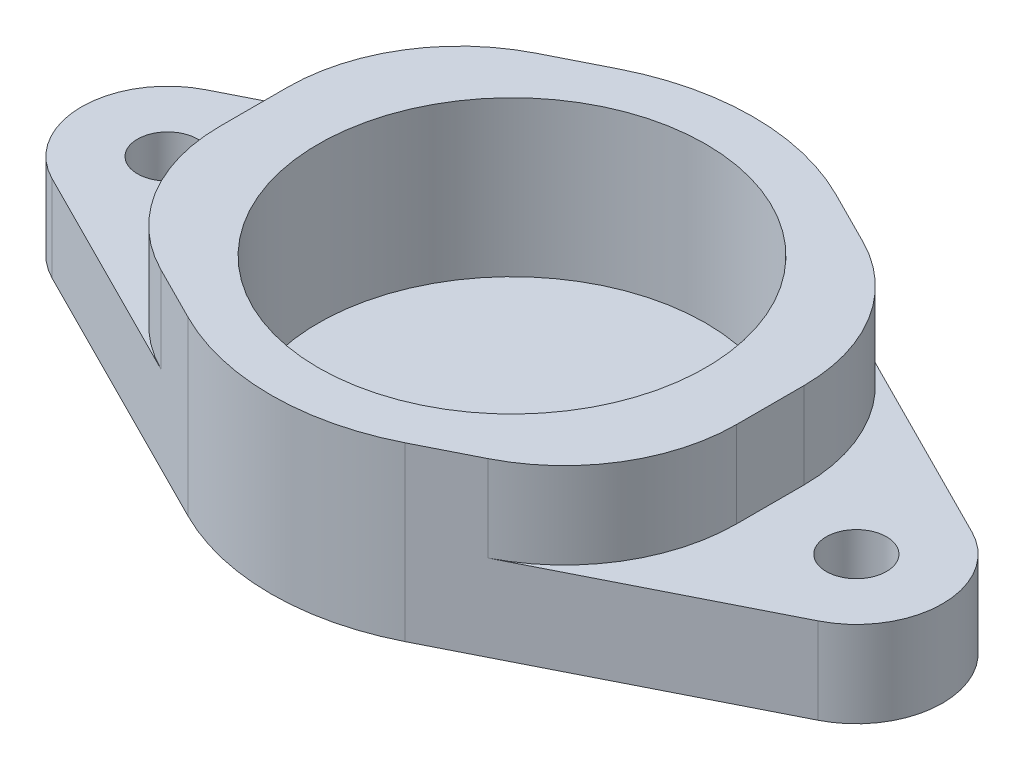
ISO-10303-21;
HEADER;
FILE_DESCRIPTION(('STEP AP214'),'2;1');
FILE_NAME('part.step','',(''),(''),'','','');
FILE_SCHEMA(('AUTOMOTIVE_DESIGN { 1 0 10303 214 1 1 1 1 }'));
ENDSEC;
DATA;
#1=APPLICATION_CONTEXT('core data for automotive mechanical design processes');
#2=APPLICATION_PROTOCOL_DEFINITION('international standard','automotive_design',2000,#1);
#3=PRODUCT_CONTEXT('',#1,'mechanical');
#4=PRODUCT('Part','Part','',(#3));
#5=PRODUCT_RELATED_PRODUCT_CATEGORY('part','',(#4));
#6=PRODUCT_DEFINITION_FORMATION('','',#4);
#7=PRODUCT_DEFINITION_CONTEXT('part definition',#1,'design');
#8=PRODUCT_DEFINITION('design','',#6,#7);
#9=PRODUCT_DEFINITION_SHAPE('','',#8);
#10=(LENGTH_UNIT() NAMED_UNIT(*) SI_UNIT(.MILLI.,.METRE.));
#11=(NAMED_UNIT(*) PLANE_ANGLE_UNIT() SI_UNIT($,.RADIAN.));
#12=(NAMED_UNIT(*) SI_UNIT($,.STERADIAN.) SOLID_ANGLE_UNIT());
#13=UNCERTAINTY_MEASURE_WITH_UNIT(LENGTH_MEASURE(1.E-05),#10,'distance_accuracy_value','');
#14=(GEOMETRIC_REPRESENTATION_CONTEXT(3) GLOBAL_UNCERTAINTY_ASSIGNED_CONTEXT((#13)) GLOBAL_UNIT_ASSIGNED_CONTEXT((#10,
#11,#12)) REPRESENTATION_CONTEXT('',''));
#15=CARTESIAN_POINT('',(0.,0.,0.));
#16=DIRECTION('',(0.,0.,1.));
#17=DIRECTION('',(1.,0.,0.));
#18=AXIS2_PLACEMENT_3D('',#15,#16,#17);
#19=CARTESIAN_POINT('',(-20.,10.,0.));
#20=DIRECTION('',(0.,1.,0.));
#21=DIRECTION('',(0.,0.,1.));
#22=AXIS2_PLACEMENT_3D('',#19,#20,#21);
#23=PLANE('',#22);
#24=DIRECTION('',(0.893028554974588,0.,-0.45));
#25=VECTOR('',#24,1.);
#26=CARTESIAN_POINT('',(6.3,10.,12.5023997696442));
#27=LINE('',#26,#25);
#28=CARTESIAN_POINT('',(6.3,10.,12.5023997696442));
#29=VERTEX_POINT('',#28);
#30=CARTESIAN_POINT('',(9.49999999999999,10.,10.8899093380914));
#31=VERTEX_POINT('',#30);
#32=EDGE_CURVE('E293',#29,#31,#27,.T.);
#33=ORIENTED_EDGE('',*,*,#32,.T.);
#34=CARTESIAN_POINT('',(4.99999999999999,10.,1.95962378834549));
#35=DIRECTION('',(0.,1.,0.));
#36=DIRECTION('',(0.,0.,1.));
#37=AXIS2_PLACEMENT_3D('',#34,#35,#36);
#38=CIRCLE('',#37,10.);
#39=CARTESIAN_POINT('',(15.,10.,1.95962378834549));
#40=VERTEX_POINT('',#39);
#41=EDGE_CURVE('E229',#31,#40,#38,.T.);
#42=ORIENTED_EDGE('',*,*,#41,.T.);
#43=DIRECTION('',(0.,0.,1.));
#44=VECTOR('',#43,1.);
#45=CARTESIAN_POINT('',(15.,10.,-14.));
#46=LINE('',#45,#44);
#47=CARTESIAN_POINT('',(15.,10.,-1.95962378834549));
#48=VERTEX_POINT('',#47);
#49=EDGE_CURVE('E279',#48,#40,#46,.T.);
#50=ORIENTED_EDGE('',*,*,#49,.F.);
#51=CARTESIAN_POINT('',(4.99999999999999,10.,-1.95962378834549));
#52=DIRECTION('',(0.,1.,0.));
#53=DIRECTION('',(0.,0.,1.));
#54=AXIS2_PLACEMENT_3D('',#51,#52,#53);
#55=CIRCLE('',#54,10.);
#56=CARTESIAN_POINT('',(9.49999999999999,10.,-10.8899093380914));
#57=VERTEX_POINT('',#56);
#58=EDGE_CURVE('E226',#48,#57,#55,.T.);
#59=ORIENTED_EDGE('',*,*,#58,.T.);
#60=DIRECTION('',(-0.893028554974588,0.,-0.45));
#61=VECTOR('',#60,1.);
#62=CARTESIAN_POINT('',(6.3,10.,-12.5023997696442));
#63=LINE('',#62,#61);
#64=CARTESIAN_POINT('',(6.3,10.,-12.5023997696442));
#65=VERTEX_POINT('',#64);
#66=EDGE_CURVE('E287',#57,#65,#63,.T.);
#67=ORIENTED_EDGE('',*,*,#66,.T.);
#68=CARTESIAN_POINT('',(0.,10.,0.));
#69=DIRECTION('',(0.,1.,0.));
#70=DIRECTION('',(0.,0.,1.));
#71=AXIS2_PLACEMENT_3D('',#68,#69,#70);
#72=CIRCLE('',#71,14.);
#73=CARTESIAN_POINT('',(-6.3,10.,-12.5023997696442));
#74=VERTEX_POINT('',#73);
#75=EDGE_CURVE('E183',#65,#74,#72,.T.);
#76=ORIENTED_EDGE('',*,*,#75,.T.);
#77=DIRECTION('',(-0.893028554974588,0.,0.45));
#78=VECTOR('',#77,1.);
#79=CARTESIAN_POINT('',(-22.25,10.,-4.46514277487293));
#80=LINE('',#79,#78);
#81=CARTESIAN_POINT('',(-9.5,10.,-10.8899093380914));
#82=VERTEX_POINT('',#81);
#83=EDGE_CURVE('E176',#74,#82,#80,.T.);
#84=ORIENTED_EDGE('',*,*,#83,.T.);
#85=CARTESIAN_POINT('',(-5.,10.,-1.95962378834549));
#86=DIRECTION('',(0.,1.,0.));
#87=DIRECTION('',(0.,0.,1.));
#88=AXIS2_PLACEMENT_3D('',#85,#86,#87);
#89=CIRCLE('',#88,10.);
#90=CARTESIAN_POINT('',(-15.,10.,-1.95962378834549));
#91=VERTEX_POINT('',#90);
#92=EDGE_CURVE('E223',#82,#91,#89,.T.);
#93=ORIENTED_EDGE('',*,*,#92,.T.);
#94=DIRECTION('',(0.,0.,1.));
#95=VECTOR('',#94,1.);
#96=CARTESIAN_POINT('',(-15.,10.,-14.));
#97=LINE('',#96,#95);
#98=CARTESIAN_POINT('',(-15.,10.,1.95962378834549));
#99=VERTEX_POINT('',#98);
#100=EDGE_CURVE('E363',#91,#99,#97,.T.);
#101=ORIENTED_EDGE('',*,*,#100,.T.);
#102=CARTESIAN_POINT('',(-5.,10.,1.95962378834549));
#103=DIRECTION('',(0.,1.,0.));
#104=DIRECTION('',(0.,0.,1.));
#105=AXIS2_PLACEMENT_3D('',#102,#103,#104);
#106=CIRCLE('',#105,10.);
#107=CARTESIAN_POINT('',(-9.5,10.,10.8899093380914));
#108=VERTEX_POINT('',#107);
#109=EDGE_CURVE('E220',#99,#108,#106,.T.);
#110=ORIENTED_EDGE('',*,*,#109,.T.);
#111=DIRECTION('',(0.893028554974588,0.,0.45));
#112=VECTOR('',#111,1.);
#113=CARTESIAN_POINT('',(-22.25,10.,4.46514277487294));
#114=LINE('',#113,#112);
#115=CARTESIAN_POINT('',(-6.3,10.,12.5023997696442));
#116=VERTEX_POINT('',#115);
#117=EDGE_CURVE('E328',#108,#116,#114,.T.);
#118=ORIENTED_EDGE('',*,*,#117,.T.);
#119=CARTESIAN_POINT('',(0.,10.,0.));
#120=DIRECTION('',(0.,1.,0.));
#121=DIRECTION('',(0.,0.,1.));
#122=AXIS2_PLACEMENT_3D('',#119,#120,#121);
#123=CIRCLE('',#122,14.);
#124=EDGE_CURVE('E298',#116,#29,#123,.T.);
#125=ORIENTED_EDGE('',*,*,#124,.T.);
#126=EDGE_LOOP('',(#33,#42,#50,#59,#67,#76,#84,#93,#101,#110,#118,#125));
#127=FACE_BOUND('',#126,.T.);
#128=CARTESIAN_POINT('',(0.,10.,0.));
#129=DIRECTION('',(0.,1.,0.));
#130=DIRECTION('',(0.,0.,1.));
#131=AXIS2_PLACEMENT_3D('',#128,#129,#130);
#132=CIRCLE('',#131,11.25);
#133=CARTESIAN_POINT('',(0.,10.,11.25));
#134=VERTEX_POINT('',#133);
#135=EDGE_CURVE('E343',#134,#134,#132,.T.);
#136=ORIENTED_EDGE('',*,*,#135,.F.);
#137=EDGE_LOOP('',(#136));
#138=FACE_BOUND('',#137,.T.);
#139=ADVANCED_FACE('F39',(#127,#138),#23,.T.);
#140=CARTESIAN_POINT('',(-20.,0.,0.));
#141=DIRECTION('',(0.,1.,0.));
#142=DIRECTION('',(0.,0.,1.));
#143=AXIS2_PLACEMENT_3D('',#140,#141,#142);
#144=PLANE('',#143);
#145=CARTESIAN_POINT('',(-20.,0.,0.));
#146=DIRECTION('',(0.,1.,0.));
#147=DIRECTION('',(0.,0.,1.));
#148=AXIS2_PLACEMENT_3D('',#145,#146,#147);
#149=CIRCLE('',#148,5.);
#150=CARTESIAN_POINT('',(-22.25,0.,-4.46514277487293));
#151=VERTEX_POINT('',#150);
#152=CARTESIAN_POINT('',(-22.25,0.,4.46514277487294));
#153=VERTEX_POINT('',#152);
#154=EDGE_CURVE('E302',#151,#153,#149,.T.);
#155=ORIENTED_EDGE('',*,*,#154,.F.);
#156=DIRECTION('',(-0.893028554974588,0.,0.45));
#157=VECTOR('',#156,1.);
#158=CARTESIAN_POINT('',(-22.25,0.,-4.46514277487293));
#159=LINE('',#158,#157);
#160=CARTESIAN_POINT('',(-6.3,0.,-12.5023997696442));
#161=VERTEX_POINT('',#160);
#162=EDGE_CURVE('E172',#161,#151,#159,.T.);
#163=ORIENTED_EDGE('',*,*,#162,.F.);
#164=CARTESIAN_POINT('',(0.,0.,0.));
#165=DIRECTION('',(0.,1.,0.));
#166=DIRECTION('',(0.,0.,1.));
#167=AXIS2_PLACEMENT_3D('',#164,#165,#166);
#168=CIRCLE('',#167,14.);
#169=CARTESIAN_POINT('',(6.3,0.,-12.5023997696442));
#170=VERTEX_POINT('',#169);
#171=EDGE_CURVE('E322',#170,#161,#168,.T.);
#172=ORIENTED_EDGE('',*,*,#171,.F.);
#173=DIRECTION('',(-0.893028554974588,0.,-0.45));
#174=VECTOR('',#173,1.);
#175=CARTESIAN_POINT('',(6.3,0.,-12.5023997696442));
#176=LINE('',#175,#174);
#177=CARTESIAN_POINT('',(22.25,0.,-4.46514277487293));
#178=VERTEX_POINT('',#177);
#179=EDGE_CURVE('E320',#178,#170,#176,.T.);
#180=ORIENTED_EDGE('',*,*,#179,.F.);
#181=CARTESIAN_POINT('',(20.,0.,0.));
#182=DIRECTION('',(0.,1.,0.));
#183=DIRECTION('',(0.,0.,1.));
#184=AXIS2_PLACEMENT_3D('',#181,#182,#183);
#185=CIRCLE('',#184,5.);
#186=CARTESIAN_POINT('',(22.25,0.,4.46514277487293));
#187=VERTEX_POINT('',#186);
#188=EDGE_CURVE('E316',#187,#178,#185,.T.);
#189=ORIENTED_EDGE('',*,*,#188,.F.);
#190=DIRECTION('',(0.893028554974588,0.,-0.45));
#191=VECTOR('',#190,1.);
#192=CARTESIAN_POINT('',(6.3,0.,12.5023997696442));
#193=LINE('',#192,#191);
#194=CARTESIAN_POINT('',(6.3,0.,12.5023997696442));
#195=VERTEX_POINT('',#194);
#196=EDGE_CURVE('E312',#195,#187,#193,.T.);
#197=ORIENTED_EDGE('',*,*,#196,.F.);
#198=CARTESIAN_POINT('',(0.,0.,0.));
#199=DIRECTION('',(0.,1.,0.));
#200=DIRECTION('',(0.,0.,1.));
#201=AXIS2_PLACEMENT_3D('',#198,#199,#200);
#202=CIRCLE('',#201,14.);
#203=CARTESIAN_POINT('',(-6.3,0.,12.5023997696442));
#204=VERTEX_POINT('',#203);
#205=EDGE_CURVE('E309',#204,#195,#202,.T.);
#206=ORIENTED_EDGE('',*,*,#205,.F.);
#207=DIRECTION('',(0.893028554974588,0.,0.45));
#208=VECTOR('',#207,1.);
#209=CARTESIAN_POINT('',(-22.25,0.,4.46514277487294));
#210=LINE('',#209,#208);
#211=EDGE_CURVE('E305',#153,#204,#210,.T.);
#212=ORIENTED_EDGE('',*,*,#211,.F.);
#213=EDGE_LOOP('',(#155,#163,#172,#180,#189,#197,#206,#212));
#214=FACE_BOUND('',#213,.T.);
#215=CARTESIAN_POINT('',(20.,0.,0.));
#216=DIRECTION('',(0.,1.,0.));
#217=DIRECTION('',(0.,0.,1.));
#218=AXIS2_PLACEMENT_3D('',#215,#216,#217);
#219=CIRCLE('',#218,1.75);
#220=CARTESIAN_POINT('',(20.,0.,1.75));
#221=VERTEX_POINT('',#220);
#222=EDGE_CURVE('E306',#221,#221,#219,.T.);
#223=ORIENTED_EDGE('',*,*,#222,.T.);
#224=EDGE_LOOP('',(#223));
#225=FACE_BOUND('',#224,.T.);
#226=CARTESIAN_POINT('',(-20.,0.,0.));
#227=DIRECTION('',(0.,1.,0.));
#228=DIRECTION('',(0.,0.,1.));
#229=AXIS2_PLACEMENT_3D('',#226,#227,#228);
#230=CIRCLE('',#229,1.75);
#231=CARTESIAN_POINT('',(-20.,0.,1.75));
#232=VERTEX_POINT('',#231);
#233=EDGE_CURVE('E338',#232,#232,#230,.T.);
#234=ORIENTED_EDGE('',*,*,#233,.T.);
#235=EDGE_LOOP('',(#234));
#236=FACE_BOUND('',#235,.T.);
#237=ADVANCED_FACE('F398',(#214,#225,#236),#144,.F.);
#238=CARTESIAN_POINT('',(-20.,10.,0.));
#239=DIRECTION('',(0.,-1.,0.));
#240=DIRECTION('',(0.,0.,-1.));
#241=AXIS2_PLACEMENT_3D('',#238,#239,#240);
#242=CYLINDRICAL_SURFACE('',#241,5.);
#243=DIRECTION('',(0.,-1.,0.));
#244=VECTOR('',#243,1.);
#245=CARTESIAN_POINT('',(-22.25,10.,4.46514277487294));
#246=LINE('',#245,#244);
#247=CARTESIAN_POINT('',(-22.25,5.,4.46514277487294));
#248=VERTEX_POINT('',#247);
#249=EDGE_CURVE('E156',#248,#153,#246,.T.);
#250=ORIENTED_EDGE('',*,*,#249,.F.);
#251=CARTESIAN_POINT('',(-20.,5.,0.));
#252=DIRECTION('',(0.,-1.,0.));
#253=DIRECTION('',(1.,0.,0.));
#254=AXIS2_PLACEMENT_3D('',#251,#252,#253);
#255=CIRCLE('',#254,5.);
#256=CARTESIAN_POINT('',(-22.25,5.,-4.46514277487293));
#257=VERTEX_POINT('',#256);
#258=EDGE_CURVE('E149',#248,#257,#255,.T.);
#259=ORIENTED_EDGE('',*,*,#258,.T.);
#260=DIRECTION('',(0.,-1.,0.));
#261=VECTOR('',#260,1.);
#262=CARTESIAN_POINT('',(-22.25,10.,-4.46514277487293));
#263=LINE('',#262,#261);
#264=EDGE_CURVE('E154',#257,#151,#263,.T.);
#265=ORIENTED_EDGE('',*,*,#264,.T.);
#266=ORIENTED_EDGE('',*,*,#154,.T.);
#267=EDGE_LOOP('',(#250,#259,#265,#266));
#268=FACE_BOUND('',#267,.T.);
#269=ADVANCED_FACE('F151',(#268),#242,.T.);
#270=CARTESIAN_POINT('',(-22.25,10.,4.46514277487294));
#271=DIRECTION('',(0.45,0.,-0.893028554974588));
#272=DIRECTION('',(-0.893028554974588,0.,-0.45));
#273=AXIS2_PLACEMENT_3D('',#270,#271,#272);
#274=PLANE('',#273);
#275=ORIENTED_EDGE('',*,*,#117,.F.);
#276=DIRECTION('',(0.,-1.,0.));
#277=VECTOR('',#276,1.);
#278=CARTESIAN_POINT('',(-9.5,10.,10.8899093380914));
#279=LINE('',#278,#277);
#280=CARTESIAN_POINT('',(-9.49999999999999,5.,10.8899093380914));
#281=VERTEX_POINT('',#280);
#282=EDGE_CURVE('E251',#108,#281,#279,.T.);
#283=ORIENTED_EDGE('',*,*,#282,.T.);
#284=DIRECTION('',(-0.893028554974588,0.,-0.45));
#285=VECTOR('',#284,1.);
#286=CARTESIAN_POINT('',(-22.25,5.,4.46514277487294));
#287=LINE('',#286,#285);
#288=EDGE_CURVE('E54',#281,#248,#287,.T.);
#289=ORIENTED_EDGE('',*,*,#288,.T.);
#290=ORIENTED_EDGE('',*,*,#249,.T.);
#291=ORIENTED_EDGE('',*,*,#211,.T.);
#292=DIRECTION('',(0.,-1.,0.));
#293=VECTOR('',#292,1.);
#294=CARTESIAN_POINT('',(-6.3,10.,12.5023997696442));
#295=LINE('',#294,#293);
#296=EDGE_CURVE('E201',#116,#204,#295,.T.);
#297=ORIENTED_EDGE('',*,*,#296,.F.);
#298=EDGE_LOOP('',(#275,#283,#289,#290,#291,#297));
#299=FACE_BOUND('',#298,.T.);
#300=ADVANCED_FACE('F377',(#299),#274,.F.);
#301=CARTESIAN_POINT('',(0.,10.,0.));
#302=DIRECTION('',(0.,-1.,0.));
#303=DIRECTION('',(0.,0.,-1.));
#304=AXIS2_PLACEMENT_3D('',#301,#302,#303);
#305=CYLINDRICAL_SURFACE('',#304,14.);
#306=ORIENTED_EDGE('',*,*,#205,.T.);
#307=DIRECTION('',(0.,-1.,0.));
#308=VECTOR('',#307,1.);
#309=CARTESIAN_POINT('',(6.3,10.,12.5023997696442));
#310=LINE('',#309,#308);
#311=EDGE_CURVE('E197',#29,#195,#310,.T.);
#312=ORIENTED_EDGE('',*,*,#311,.F.);
#313=ORIENTED_EDGE('',*,*,#124,.F.);
#314=ORIENTED_EDGE('',*,*,#296,.T.);
#315=EDGE_LOOP('',(#306,#312,#313,#314));
#316=FACE_BOUND('',#315,.T.);
#317=ADVANCED_FACE('F383',(#316),#305,.T.);
#318=CARTESIAN_POINT('',(6.3,10.,12.5023997696442));
#319=DIRECTION('',(-0.45,0.,-0.893028554974588));
#320=DIRECTION('',(-0.893028554974588,0.,0.45));
#321=AXIS2_PLACEMENT_3D('',#318,#319,#320);
#322=PLANE('',#321);
#323=DIRECTION('',(-0.893028554974588,0.,0.45));
#324=VECTOR('',#323,1.);
#325=CARTESIAN_POINT('',(6.3,5.,12.5023997696442));
#326=LINE('',#325,#324);
#327=CARTESIAN_POINT('',(22.25,5.,4.46514277487293));
#328=VERTEX_POINT('',#327);
#329=CARTESIAN_POINT('',(9.49999999999999,5.,10.8899093380914));
#330=VERTEX_POINT('',#329);
#331=EDGE_CURVE('E347',#328,#330,#326,.T.);
#332=ORIENTED_EDGE('',*,*,#331,.T.);
#333=DIRECTION('',(0.,1.,0.));
#334=VECTOR('',#333,1.);
#335=CARTESIAN_POINT('',(9.49999999999999,10.,10.8899093380914));
#336=LINE('',#335,#334);
#337=EDGE_CURVE('E207',#330,#31,#336,.T.);
#338=ORIENTED_EDGE('',*,*,#337,.T.);
#339=ORIENTED_EDGE('',*,*,#32,.F.);
#340=ORIENTED_EDGE('',*,*,#311,.T.);
#341=ORIENTED_EDGE('',*,*,#196,.T.);
#342=DIRECTION('',(0.,-1.,0.));
#343=VECTOR('',#342,1.);
#344=CARTESIAN_POINT('',(22.25,10.,4.46514277487293));
#345=LINE('',#344,#343);
#346=EDGE_CURVE('E194',#328,#187,#345,.T.);
#347=ORIENTED_EDGE('',*,*,#346,.F.);
#348=EDGE_LOOP('',(#332,#338,#339,#340,#341,#347));
#349=FACE_BOUND('',#348,.T.);
#350=ADVANCED_FACE('F386',(#349),#322,.F.);
#351=CARTESIAN_POINT('',(20.,10.,0.));
#352=DIRECTION('',(0.,-1.,0.));
#353=DIRECTION('',(0.,0.,-1.));
#354=AXIS2_PLACEMENT_3D('',#351,#352,#353);
#355=CYLINDRICAL_SURFACE('',#354,5.);
#356=DIRECTION('',(0.,-1.,0.));
#357=VECTOR('',#356,1.);
#358=CARTESIAN_POINT('',(22.25,10.,-4.46514277487293));
#359=LINE('',#358,#357);
#360=CARTESIAN_POINT('',(22.25,5.,-4.46514277487293));
#361=VERTEX_POINT('',#360);
#362=EDGE_CURVE('E191',#361,#178,#359,.T.);
#363=ORIENTED_EDGE('',*,*,#362,.F.);
#364=CARTESIAN_POINT('',(20.,5.,0.));
#365=DIRECTION('',(0.,-1.,0.));
#366=DIRECTION('',(0.,0.,-1.));
#367=AXIS2_PLACEMENT_3D('',#364,#365,#366);
#368=CIRCLE('',#367,5.);
#369=EDGE_CURVE('E353',#361,#328,#368,.T.);
#370=ORIENTED_EDGE('',*,*,#369,.T.);
#371=ORIENTED_EDGE('',*,*,#346,.T.);
#372=ORIENTED_EDGE('',*,*,#188,.T.);
#373=EDGE_LOOP('',(#363,#370,#371,#372));
#374=FACE_BOUND('',#373,.T.);
#375=ADVANCED_FACE('F394',(#374),#355,.T.);
#376=CARTESIAN_POINT('',(6.3,10.,-12.5023997696442));
#377=DIRECTION('',(-0.45,0.,0.893028554974588));
#378=DIRECTION('',(0.893028554974588,0.,0.45));
#379=AXIS2_PLACEMENT_3D('',#376,#377,#378);
#380=PLANE('',#379);
#381=ORIENTED_EDGE('',*,*,#66,.F.);
#382=DIRECTION('',(0.,-1.,0.));
#383=VECTOR('',#382,1.);
#384=CARTESIAN_POINT('',(9.49999999999999,10.,-10.8899093380914));
#385=LINE('',#384,#383);
#386=CARTESIAN_POINT('',(9.49999999999999,5.,-10.8899093380914));
#387=VERTEX_POINT('',#386);
#388=EDGE_CURVE('E238',#57,#387,#385,.T.);
#389=ORIENTED_EDGE('',*,*,#388,.T.);
#390=DIRECTION('',(0.893028554974588,0.,0.45));
#391=VECTOR('',#390,1.);
#392=CARTESIAN_POINT('',(6.3,5.,-12.5023997696442));
#393=LINE('',#392,#391);
#394=EDGE_CURVE('E216',#387,#361,#393,.T.);
#395=ORIENTED_EDGE('',*,*,#394,.T.);
#396=ORIENTED_EDGE('',*,*,#362,.T.);
#397=ORIENTED_EDGE('',*,*,#179,.T.);
#398=DIRECTION('',(0.,-1.,0.));
#399=VECTOR('',#398,1.);
#400=CARTESIAN_POINT('',(6.3,10.,-12.5023997696442));
#401=LINE('',#400,#399);
#402=EDGE_CURVE('E180',#65,#170,#401,.T.);
#403=ORIENTED_EDGE('',*,*,#402,.F.);
#404=EDGE_LOOP('',(#381,#389,#395,#396,#397,#403));
#405=FACE_BOUND('',#404,.T.);
#406=ADVANCED_FACE('F290',(#405),#380,.F.);
#407=CARTESIAN_POINT('',(0.,10.,0.));
#408=DIRECTION('',(0.,-1.,0.));
#409=DIRECTION('',(0.,0.,-1.));
#410=AXIS2_PLACEMENT_3D('',#407,#408,#409);
#411=CYLINDRICAL_SURFACE('',#410,14.);
#412=ORIENTED_EDGE('',*,*,#171,.T.);
#413=DIRECTION('',(0.,-1.,0.));
#414=VECTOR('',#413,1.);
#415=CARTESIAN_POINT('',(-6.3,10.,-12.5023997696442));
#416=LINE('',#415,#414);
#417=EDGE_CURVE('E175',#74,#161,#416,.T.);
#418=ORIENTED_EDGE('',*,*,#417,.F.);
#419=ORIENTED_EDGE('',*,*,#75,.F.);
#420=ORIENTED_EDGE('',*,*,#402,.T.);
#421=EDGE_LOOP('',(#412,#418,#419,#420));
#422=FACE_BOUND('',#421,.T.);
#423=ADVANCED_FACE('F400',(#422),#411,.T.);
#424=CARTESIAN_POINT('',(-22.25,10.,-4.46514277487293));
#425=DIRECTION('',(0.45,0.,0.893028554974588));
#426=DIRECTION('',(0.893028554974588,0.,-0.45));
#427=AXIS2_PLACEMENT_3D('',#424,#425,#426);
#428=PLANE('',#427);
#429=DIRECTION('',(0.893028554974588,0.,-0.45));
#430=VECTOR('',#429,1.);
#431=CARTESIAN_POINT('',(-22.25,5.,-4.46514277487293));
#432=LINE('',#431,#430);
#433=CARTESIAN_POINT('',(-9.5,5.,-10.8899093380914));
#434=VERTEX_POINT('',#433);
#435=EDGE_CURVE('E158',#257,#434,#432,.T.);
#436=ORIENTED_EDGE('',*,*,#435,.T.);
#437=DIRECTION('',(0.,1.,0.));
#438=VECTOR('',#437,1.);
#439=CARTESIAN_POINT('',(-9.5,10.,-10.8899093380914));
#440=LINE('',#439,#438);
#441=EDGE_CURVE('E242',#434,#82,#440,.T.);
#442=ORIENTED_EDGE('',*,*,#441,.T.);
#443=ORIENTED_EDGE('',*,*,#83,.F.);
#444=ORIENTED_EDGE('',*,*,#417,.T.);
#445=ORIENTED_EDGE('',*,*,#162,.T.);
#446=ORIENTED_EDGE('',*,*,#264,.F.);
#447=EDGE_LOOP('',(#436,#442,#443,#444,#445,#446));
#448=FACE_BOUND('',#447,.T.);
#449=ADVANCED_FACE('F169',(#448),#428,.F.);
#450=CARTESIAN_POINT('',(20.,10.,0.));
#451=DIRECTION('',(0.,-1.,0.));
#452=DIRECTION('',(0.,0.,-1.));
#453=AXIS2_PLACEMENT_3D('',#450,#451,#452);
#454=CYLINDRICAL_SURFACE('',#453,1.75);
#455=CARTESIAN_POINT('',(20.,5.,0.));
#456=DIRECTION('',(0.,-1.,0.));
#457=DIRECTION('',(0.,0.,-1.));
#458=AXIS2_PLACEMENT_3D('',#455,#456,#457);
#459=CIRCLE('',#458,1.75);
#460=CARTESIAN_POINT('',(20.,5.,-1.75));
#461=VERTEX_POINT('',#460);
#462=EDGE_CURVE('E212',#461,#461,#459,.T.);
#463=ORIENTED_EDGE('',*,*,#462,.F.);
#464=EDGE_LOOP('',(#463));
#465=FACE_BOUND('',#464,.T.);
#466=ORIENTED_EDGE('',*,*,#222,.F.);
#467=EDGE_LOOP('',(#466));
#468=FACE_BOUND('',#467,.T.);
#469=ADVANCED_FACE('F417',(#465,#468),#454,.F.);
#470=CARTESIAN_POINT('',(-20.,10.,0.));
#471=DIRECTION('',(0.,-1.,0.));
#472=DIRECTION('',(0.,0.,-1.));
#473=AXIS2_PLACEMENT_3D('',#470,#471,#472);
#474=CYLINDRICAL_SURFACE('',#473,1.75);
#475=CARTESIAN_POINT('',(-20.,5.,0.));
#476=DIRECTION('',(0.,-1.,0.));
#477=DIRECTION('',(1.,0.,0.));
#478=AXIS2_PLACEMENT_3D('',#475,#476,#477);
#479=CIRCLE('',#478,1.75);
#480=CARTESIAN_POINT('',(-18.25,5.,0.));
#481=VERTEX_POINT('',#480);
#482=EDGE_CURVE('E167',#481,#481,#479,.T.);
#483=ORIENTED_EDGE('',*,*,#482,.F.);
#484=EDGE_LOOP('',(#483));
#485=FACE_BOUND('',#484,.T.);
#486=ORIENTED_EDGE('',*,*,#233,.F.);
#487=EDGE_LOOP('',(#486));
#488=FACE_BOUND('',#487,.T.);
#489=ADVANCED_FACE('F455',(#485,#488),#474,.F.);
#490=CARTESIAN_POINT('',(0.,1.,0.));
#491=DIRECTION('',(0.,1.,0.));
#492=DIRECTION('',(0.,0.,1.));
#493=AXIS2_PLACEMENT_3D('',#490,#491,#492);
#494=CYLINDRICAL_SURFACE('',#493,11.25);
#495=CARTESIAN_POINT('',(0.,1.,0.));
#496=DIRECTION('',(0.,1.,0.));
#497=DIRECTION('',(0.,0.,1.));
#498=AXIS2_PLACEMENT_3D('',#495,#496,#497);
#499=CIRCLE('',#498,11.25);
#500=CARTESIAN_POINT('',(0.,1.,11.25));
#501=VERTEX_POINT('',#500);
#502=EDGE_CURVE('E342',#501,#501,#499,.T.);
#503=ORIENTED_EDGE('',*,*,#502,.F.);
#504=EDGE_LOOP('',(#503));
#505=FACE_BOUND('',#504,.T.);
#506=ORIENTED_EDGE('',*,*,#135,.T.);
#507=EDGE_LOOP('',(#506));
#508=FACE_BOUND('',#507,.T.);
#509=ADVANCED_FACE('F452',(#505,#508),#494,.F.);
#510=CARTESIAN_POINT('',(0.,1.,0.));
#511=DIRECTION('',(0.,1.,0.));
#512=DIRECTION('',(0.,0.,1.));
#513=AXIS2_PLACEMENT_3D('',#510,#511,#512);
#514=PLANE('',#513);
#515=ORIENTED_EDGE('',*,*,#502,.T.);
#516=EDGE_LOOP('',(#515));
#517=FACE_BOUND('',#516,.T.);
#518=ADVANCED_FACE('F449',(#517),#514,.T.);
#519=CARTESIAN_POINT('',(-15.,10.,-14.));
#520=DIRECTION('',(1.,0.,0.));
#521=DIRECTION('',(0.,0.,-1.));
#522=AXIS2_PLACEMENT_3D('',#519,#520,#521);
#523=PLANE('',#522);
#524=ORIENTED_EDGE('',*,*,#100,.F.);
#525=DIRECTION('',(0.,1.,0.));
#526=VECTOR('',#525,1.);
#527=CARTESIAN_POINT('',(-15.,10.,-1.95962378834549));
#528=LINE('',#527,#526);
#529=CARTESIAN_POINT('',(-15.,5.,-1.95962378834549));
#530=VERTEX_POINT('',#529);
#531=EDGE_CURVE('E248',#91,#530,#528,.F.);
#532=ORIENTED_EDGE('',*,*,#531,.T.);
#533=DIRECTION('',(0.,0.,1.));
#534=VECTOR('',#533,1.);
#535=CARTESIAN_POINT('',(-15.,5.,-14.));
#536=LINE('',#535,#534);
#537=CARTESIAN_POINT('',(-15.,5.,1.95962378834549));
#538=VERTEX_POINT('',#537);
#539=EDGE_CURVE('E211',#530,#538,#536,.T.);
#540=ORIENTED_EDGE('',*,*,#539,.T.);
#541=DIRECTION('',(0.,-1.,0.));
#542=VECTOR('',#541,1.);
#543=CARTESIAN_POINT('',(-15.,10.,1.95962378834549));
#544=LINE('',#543,#542);
#545=EDGE_CURVE('E245',#538,#99,#544,.F.);
#546=ORIENTED_EDGE('',*,*,#545,.T.);
#547=EDGE_LOOP('',(#524,#532,#540,#546));
#548=FACE_BOUND('',#547,.T.);
#549=ADVANCED_FACE('F371',(#548),#523,.F.);
#550=CARTESIAN_POINT('',(-15.,5.,-14.));
#551=DIRECTION('',(0.,-1.,0.));
#552=DIRECTION('',(1.,0.,0.));
#553=AXIS2_PLACEMENT_3D('',#550,#551,#552);
#554=PLANE('',#553);
#555=ORIENTED_EDGE('',*,*,#482,.T.);
#556=EDGE_LOOP('',(#555));
#557=FACE_BOUND('',#556,.T.);
#558=ORIENTED_EDGE('',*,*,#539,.F.);
#559=CARTESIAN_POINT('',(-5.,5.,-1.95962378834549));
#560=DIRECTION('',(0.,-1.,0.));
#561=DIRECTION('',(1.,0.,0.));
#562=AXIS2_PLACEMENT_3D('',#559,#560,#561);
#563=CIRCLE('',#562,10.);
#564=EDGE_CURVE('E48',#530,#434,#563,.T.);
#565=ORIENTED_EDGE('',*,*,#564,.T.);
#566=ORIENTED_EDGE('',*,*,#435,.F.);
#567=ORIENTED_EDGE('',*,*,#258,.F.);
#568=ORIENTED_EDGE('',*,*,#288,.F.);
#569=CARTESIAN_POINT('',(-5.,5.,1.95962378834549));
#570=DIRECTION('',(0.,-1.,0.));
#571=DIRECTION('',(1.,0.,0.));
#572=AXIS2_PLACEMENT_3D('',#569,#570,#571);
#573=CIRCLE('',#572,10.);
#574=EDGE_CURVE('E11',#281,#538,#573,.T.);
#575=ORIENTED_EDGE('',*,*,#574,.T.);
#576=EDGE_LOOP('',(#558,#565,#566,#567,#568,#575));
#577=FACE_BOUND('',#576,.T.);
#578=ADVANCED_FACE('F161',(#557,#577),#554,.F.);
#579=CARTESIAN_POINT('',(15.,10.,-14.));
#580=DIRECTION('',(-1.,0.,0.));
#581=DIRECTION('',(0.,0.,1.));
#582=AXIS2_PLACEMENT_3D('',#579,#580,#581);
#583=PLANE('',#582);
#584=ORIENTED_EDGE('',*,*,#49,.T.);
#585=DIRECTION('',(0.,1.,0.));
#586=VECTOR('',#585,1.);
#587=CARTESIAN_POINT('',(15.,10.,1.95962378834549));
#588=LINE('',#587,#586);
#589=CARTESIAN_POINT('',(15.,5.,1.95962378834549));
#590=VERTEX_POINT('',#589);
#591=EDGE_CURVE('E235',#40,#590,#588,.F.);
#592=ORIENTED_EDGE('',*,*,#591,.T.);
#593=DIRECTION('',(0.,0.,1.));
#594=VECTOR('',#593,1.);
#595=CARTESIAN_POINT('',(15.,5.,-14.));
#596=LINE('',#595,#594);
#597=CARTESIAN_POINT('',(15.,5.,-1.95962378834549));
#598=VERTEX_POINT('',#597);
#599=EDGE_CURVE('E267',#598,#590,#596,.T.);
#600=ORIENTED_EDGE('',*,*,#599,.F.);
#601=DIRECTION('',(0.,-1.,0.));
#602=VECTOR('',#601,1.);
#603=CARTESIAN_POINT('',(15.,10.,-1.95962378834549));
#604=LINE('',#603,#602);
#605=EDGE_CURVE('E232',#598,#48,#604,.F.);
#606=ORIENTED_EDGE('',*,*,#605,.T.);
#607=EDGE_LOOP('',(#584,#592,#600,#606));
#608=FACE_BOUND('',#607,.T.);
#609=ADVANCED_FACE('F275',(#608),#583,.F.);
#610=CARTESIAN_POINT('',(15.,5.,-14.));
#611=DIRECTION('',(0.,-1.,0.));
#612=DIRECTION('',(0.,0.,-1.));
#613=AXIS2_PLACEMENT_3D('',#610,#611,#612);
#614=PLANE('',#613);
#615=ORIENTED_EDGE('',*,*,#462,.T.);
#616=EDGE_LOOP('',(#615));
#617=FACE_BOUND('',#616,.T.);
#618=ORIENTED_EDGE('',*,*,#369,.F.);
#619=ORIENTED_EDGE('',*,*,#394,.F.);
#620=CARTESIAN_POINT('',(4.99999999999999,5.,-1.95962378834549));
#621=DIRECTION('',(0.,-1.,0.));
#622=DIRECTION('',(0.,0.,-1.));
#623=AXIS2_PLACEMENT_3D('',#620,#621,#622);
#624=CIRCLE('',#623,10.);
#625=EDGE_CURVE('E259',#387,#598,#624,.T.);
#626=ORIENTED_EDGE('',*,*,#625,.T.);
#627=ORIENTED_EDGE('',*,*,#599,.T.);
#628=CARTESIAN_POINT('',(4.99999999999999,5.,1.95962378834549));
#629=DIRECTION('',(0.,-1.,0.));
#630=DIRECTION('',(0.,0.,-1.));
#631=AXIS2_PLACEMENT_3D('',#628,#629,#630);
#632=CIRCLE('',#631,10.);
#633=EDGE_CURVE('E255',#590,#330,#632,.T.);
#634=ORIENTED_EDGE('',*,*,#633,.T.);
#635=ORIENTED_EDGE('',*,*,#331,.F.);
#636=EDGE_LOOP('',(#618,#619,#626,#627,#634,#635));
#637=FACE_BOUND('',#636,.T.);
#638=ADVANCED_FACE('F266',(#617,#637),#614,.F.);
#639=CARTESIAN_POINT('',(4.99999999999999,10.,1.95962378834549));
#640=DIRECTION('',(0.,1.,0.));
#641=DIRECTION('',(0.,0.,1.));
#642=AXIS2_PLACEMENT_3D('',#639,#640,#641);
#643=CYLINDRICAL_SURFACE('',#642,10.);
#644=ORIENTED_EDGE('',*,*,#633,.F.);
#645=ORIENTED_EDGE('',*,*,#591,.F.);
#646=ORIENTED_EDGE('',*,*,#41,.F.);
#647=ORIENTED_EDGE('',*,*,#337,.F.);
#648=EDGE_LOOP('',(#644,#645,#646,#647));
#649=FACE_BOUND('',#648,.T.);
#650=ADVANCED_FACE('F391',(#649),#643,.T.);
#651=CARTESIAN_POINT('',(4.99999999999999,10.,-1.95962378834549));
#652=DIRECTION('',(0.,-1.,0.));
#653=DIRECTION('',(0.,0.,-1.));
#654=AXIS2_PLACEMENT_3D('',#651,#652,#653);
#655=CYLINDRICAL_SURFACE('',#654,10.);
#656=ORIENTED_EDGE('',*,*,#58,.F.);
#657=ORIENTED_EDGE('',*,*,#605,.F.);
#658=ORIENTED_EDGE('',*,*,#625,.F.);
#659=ORIENTED_EDGE('',*,*,#388,.F.);
#660=EDGE_LOOP('',(#656,#657,#658,#659));
#661=FACE_BOUND('',#660,.T.);
#662=ADVANCED_FACE('F282',(#661),#655,.T.);
#663=CARTESIAN_POINT('',(-5.,10.,-1.95962378834549));
#664=DIRECTION('',(0.,1.,0.));
#665=DIRECTION('',(0.,0.,1.));
#666=AXIS2_PLACEMENT_3D('',#663,#664,#665);
#667=CYLINDRICAL_SURFACE('',#666,10.);
#668=ORIENTED_EDGE('',*,*,#564,.F.);
#669=ORIENTED_EDGE('',*,*,#531,.F.);
#670=ORIENTED_EDGE('',*,*,#92,.F.);
#671=ORIENTED_EDGE('',*,*,#441,.F.);
#672=EDGE_LOOP('',(#668,#669,#670,#671));
#673=FACE_BOUND('',#672,.T.);
#674=ADVANCED_FACE('F403',(#673),#667,.T.);
#675=CARTESIAN_POINT('',(-5.,10.,1.95962378834549));
#676=DIRECTION('',(0.,-1.,0.));
#677=DIRECTION('',(0.,0.,-1.));
#678=AXIS2_PLACEMENT_3D('',#675,#676,#677);
#679=CYLINDRICAL_SURFACE('',#678,10.);
#680=ORIENTED_EDGE('',*,*,#109,.F.);
#681=ORIENTED_EDGE('',*,*,#545,.F.);
#682=ORIENTED_EDGE('',*,*,#574,.F.);
#683=ORIENTED_EDGE('',*,*,#282,.F.);
#684=EDGE_LOOP('',(#680,#681,#682,#683));
#685=FACE_BOUND('',#684,.T.);
#686=ADVANCED_FACE('F41',(#685),#679,.T.);
#687=CLOSED_SHELL('',(#139,#237,#269,#300,#317,#350,#375,#406,#423,#449,#469,#489,#509,#518,
#549,#578,#609,#638,#650,#662,#674,#686));
#688=MANIFOLD_SOLID_BREP('B2',#687);
#689=ADVANCED_BREP_SHAPE_REPRESENTATION('',(#18,#688),#14);
#690=SHAPE_DEFINITION_REPRESENTATION(#9,#689);
ENDSEC;
END-ISO-10303-21;
